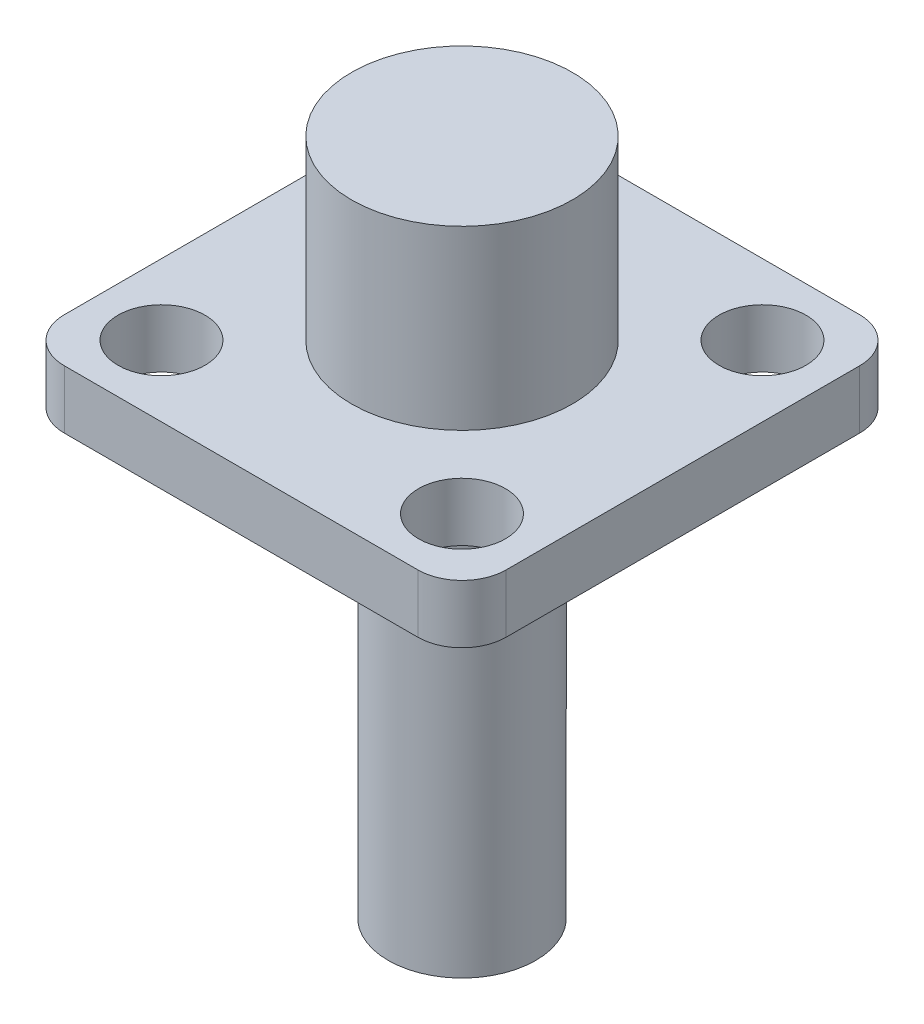
ISO-10303-21;
HEADER;
FILE_DESCRIPTION(('STEP AP214'),'2;1');
FILE_NAME('part.step','',(''),(''),'','','');
FILE_SCHEMA(('AUTOMOTIVE_DESIGN { 1 0 10303 214 1 1 1 1 }'));
ENDSEC;
DATA;
#1=APPLICATION_CONTEXT('core data for automotive mechanical design processes');
#2=APPLICATION_PROTOCOL_DEFINITION('international standard','automotive_design',2000,#1);
#3=PRODUCT_CONTEXT('',#1,'mechanical');
#4=PRODUCT('Part','Part','',(#3));
#5=PRODUCT_RELATED_PRODUCT_CATEGORY('part','',(#4));
#6=PRODUCT_DEFINITION_FORMATION('','',#4);
#7=PRODUCT_DEFINITION_CONTEXT('part definition',#1,'design');
#8=PRODUCT_DEFINITION('design','',#6,#7);
#9=PRODUCT_DEFINITION_SHAPE('','',#8);
#10=(LENGTH_UNIT() NAMED_UNIT(*) SI_UNIT(.MILLI.,.METRE.));
#11=(NAMED_UNIT(*) PLANE_ANGLE_UNIT() SI_UNIT($,.RADIAN.));
#12=(NAMED_UNIT(*) SI_UNIT($,.STERADIAN.) SOLID_ANGLE_UNIT());
#13=UNCERTAINTY_MEASURE_WITH_UNIT(LENGTH_MEASURE(1.E-05),#10,'distance_accuracy_value','');
#14=(GEOMETRIC_REPRESENTATION_CONTEXT(3) GLOBAL_UNCERTAINTY_ASSIGNED_CONTEXT((#13)) GLOBAL_UNIT_ASSIGNED_CONTEXT((#10,
#11,#12)) REPRESENTATION_CONTEXT('',''));
#15=CARTESIAN_POINT('',(0.,0.,0.));
#16=DIRECTION('',(0.,0.,1.));
#17=DIRECTION('',(1.,0.,0.));
#18=AXIS2_PLACEMENT_3D('',#15,#16,#17);
#19=CARTESIAN_POINT('',(5.08,1.6764,5.08));
#20=DIRECTION('',(0.,-1.,0.));
#21=DIRECTION('',(0.,0.,-1.));
#22=AXIS2_PLACEMENT_3D('',#19,#20,#21);
#23=CYLINDRICAL_SURFACE('',#22,1.27);
#24=CARTESIAN_POINT('',(5.08,0.,5.08));
#25=DIRECTION('',(0.,1.,0.));
#26=DIRECTION('',(0.,0.,1.));
#27=AXIS2_PLACEMENT_3D('',#24,#25,#26);
#28=CIRCLE('',#27,1.27);
#29=CARTESIAN_POINT('',(5.07999999999999,0.,6.35));
#30=VERTEX_POINT('',#29);
#31=CARTESIAN_POINT('',(6.35,0.,5.07999999999999));
#32=VERTEX_POINT('',#31);
#33=EDGE_CURVE('E150',#30,#32,#28,.T.);
#34=ORIENTED_EDGE('',*,*,#33,.T.);
#35=DIRECTION('',(0.,-1.,0.));
#36=VECTOR('',#35,1.);
#37=CARTESIAN_POINT('',(6.35,1.6764,5.07999999999999));
#38=LINE('',#37,#36);
#39=CARTESIAN_POINT('',(6.35,1.6764,5.07999999999999));
#40=VERTEX_POINT('',#39);
#41=EDGE_CURVE('E57',#40,#32,#38,.T.);
#42=ORIENTED_EDGE('',*,*,#41,.F.);
#43=CARTESIAN_POINT('',(5.08,1.6764,5.08));
#44=DIRECTION('',(0.,1.,0.));
#45=DIRECTION('',(0.,0.,1.));
#46=AXIS2_PLACEMENT_3D('',#43,#44,#45);
#47=CIRCLE('',#46,1.27);
#48=CARTESIAN_POINT('',(5.07999999999999,1.6764,6.35));
#49=VERTEX_POINT('',#48);
#50=EDGE_CURVE('E173',#49,#40,#47,.T.);
#51=ORIENTED_EDGE('',*,*,#50,.F.);
#52=DIRECTION('',(0.,-1.,0.));
#53=VECTOR('',#52,1.);
#54=CARTESIAN_POINT('',(5.07999999999999,1.6764,6.35));
#55=LINE('',#54,#53);
#56=EDGE_CURVE('E146',#49,#30,#55,.T.);
#57=ORIENTED_EDGE('',*,*,#56,.T.);
#58=EDGE_LOOP('',(#34,#42,#51,#57));
#59=FACE_BOUND('',#58,.T.);
#60=ADVANCED_FACE('F48',(#59),#23,.T.);
#61=CARTESIAN_POINT('',(6.35,1.6764,5.07999999999999));
#62=DIRECTION('',(-1.,0.,0.));
#63=DIRECTION('',(0.,0.,1.));
#64=AXIS2_PLACEMENT_3D('',#61,#62,#63);
#65=PLANE('',#64);
#66=DIRECTION('',(0.,0.,-1.));
#67=VECTOR('',#66,1.);
#68=CARTESIAN_POINT('',(6.35,0.,5.07999999999999));
#69=LINE('',#68,#67);
#70=CARTESIAN_POINT('',(6.35,0.,-5.07999999999999));
#71=VERTEX_POINT('',#70);
#72=EDGE_CURVE('E154',#32,#71,#69,.T.);
#73=ORIENTED_EDGE('',*,*,#72,.T.);
#74=DIRECTION('',(0.,-1.,0.));
#75=VECTOR('',#74,1.);
#76=CARTESIAN_POINT('',(6.35,1.6764,-5.07999999999999));
#77=LINE('',#76,#75);
#78=CARTESIAN_POINT('',(6.35,1.6764,-5.07999999999999));
#79=VERTEX_POINT('',#78);
#80=EDGE_CURVE('E188',#79,#71,#77,.T.);
#81=ORIENTED_EDGE('',*,*,#80,.F.);
#82=DIRECTION('',(0.,0.,-1.));
#83=VECTOR('',#82,1.);
#84=CARTESIAN_POINT('',(6.35,1.6764,5.07999999999999));
#85=LINE('',#84,#83);
#86=EDGE_CURVE('E109',#40,#79,#85,.T.);
#87=ORIENTED_EDGE('',*,*,#86,.F.);
#88=ORIENTED_EDGE('',*,*,#41,.T.);
#89=EDGE_LOOP('',(#73,#81,#87,#88));
#90=FACE_BOUND('',#89,.T.);
#91=ADVANCED_FACE('F193',(#90),#65,.F.);
#92=CARTESIAN_POINT('',(5.08,1.6764,-5.08));
#93=DIRECTION('',(0.,-1.,0.));
#94=DIRECTION('',(0.,0.,-1.));
#95=AXIS2_PLACEMENT_3D('',#92,#93,#94);
#96=CYLINDRICAL_SURFACE('',#95,1.27);
#97=CARTESIAN_POINT('',(5.08,0.,-5.08));
#98=DIRECTION('',(0.,1.,0.));
#99=DIRECTION('',(0.,0.,-1.));
#100=AXIS2_PLACEMENT_3D('',#97,#98,#99);
#101=CIRCLE('',#100,1.27);
#102=CARTESIAN_POINT('',(5.07999999999999,0.,-6.35));
#103=VERTEX_POINT('',#102);
#104=EDGE_CURVE('E158',#71,#103,#101,.T.);
#105=ORIENTED_EDGE('',*,*,#104,.T.);
#106=DIRECTION('',(0.,-1.,0.));
#107=VECTOR('',#106,1.);
#108=CARTESIAN_POINT('',(5.07999999999999,1.6764,-6.35));
#109=LINE('',#108,#107);
#110=CARTESIAN_POINT('',(5.07999999999999,1.6764,-6.35));
#111=VERTEX_POINT('',#110);
#112=EDGE_CURVE('E184',#111,#103,#109,.T.);
#113=ORIENTED_EDGE('',*,*,#112,.F.);
#114=CARTESIAN_POINT('',(5.08,1.6764,-5.08));
#115=DIRECTION('',(0.,1.,0.));
#116=DIRECTION('',(0.,0.,-1.));
#117=AXIS2_PLACEMENT_3D('',#114,#115,#116);
#118=CIRCLE('',#117,1.27);
#119=EDGE_CURVE('E212',#79,#111,#118,.T.);
#120=ORIENTED_EDGE('',*,*,#119,.F.);
#121=ORIENTED_EDGE('',*,*,#80,.T.);
#122=EDGE_LOOP('',(#105,#113,#120,#121));
#123=FACE_BOUND('',#122,.T.);
#124=ADVANCED_FACE('F204',(#123),#96,.T.);
#125=CARTESIAN_POINT('',(-5.07999999999999,1.6764,-6.35));
#126=DIRECTION('',(0.,0.,1.));
#127=DIRECTION('',(1.,0.,0.));
#128=AXIS2_PLACEMENT_3D('',#125,#126,#127);
#129=PLANE('',#128);
#130=DIRECTION('',(-1.,0.,0.));
#131=VECTOR('',#130,1.);
#132=CARTESIAN_POINT('',(-5.07999999999999,0.,-6.35));
#133=LINE('',#132,#131);
#134=CARTESIAN_POINT('',(-5.08,0.,-6.35));
#135=VERTEX_POINT('',#134);
#136=EDGE_CURVE('E161',#103,#135,#133,.T.);
#137=ORIENTED_EDGE('',*,*,#136,.T.);
#138=DIRECTION('',(0.,-1.,0.));
#139=VECTOR('',#138,1.);
#140=CARTESIAN_POINT('',(-5.08,1.6764,-6.35));
#141=LINE('',#140,#139);
#142=CARTESIAN_POINT('',(-5.08,1.6764,-6.35));
#143=VERTEX_POINT('',#142);
#144=EDGE_CURVE('E180',#143,#135,#141,.T.);
#145=ORIENTED_EDGE('',*,*,#144,.F.);
#146=DIRECTION('',(-1.,0.,0.));
#147=VECTOR('',#146,1.);
#148=CARTESIAN_POINT('',(-5.07999999999999,1.6764,-6.35));
#149=LINE('',#148,#147);
#150=EDGE_CURVE('E210',#111,#143,#149,.T.);
#151=ORIENTED_EDGE('',*,*,#150,.F.);
#152=ORIENTED_EDGE('',*,*,#112,.T.);
#153=EDGE_LOOP('',(#137,#145,#151,#152));
#154=FACE_BOUND('',#153,.T.);
#155=ADVANCED_FACE('F208',(#154),#129,.F.);
#156=CARTESIAN_POINT('',(-5.08,1.6764,-5.08));
#157=DIRECTION('',(0.,-1.,0.));
#158=DIRECTION('',(0.,0.,-1.));
#159=AXIS2_PLACEMENT_3D('',#156,#157,#158);
#160=CYLINDRICAL_SURFACE('',#159,1.27);
#161=CARTESIAN_POINT('',(-5.08,0.,-5.08));
#162=DIRECTION('',(0.,1.,0.));
#163=DIRECTION('',(0.,0.,-1.));
#164=AXIS2_PLACEMENT_3D('',#161,#162,#163);
#165=CIRCLE('',#164,1.27);
#166=CARTESIAN_POINT('',(-6.35,0.,-5.07999999999999));
#167=VERTEX_POINT('',#166);
#168=EDGE_CURVE('E164',#135,#167,#165,.T.);
#169=ORIENTED_EDGE('',*,*,#168,.T.);
#170=DIRECTION('',(0.,-1.,0.));
#171=VECTOR('',#170,1.);
#172=CARTESIAN_POINT('',(-6.35,1.6764,-5.07999999999999));
#173=LINE('',#172,#171);
#174=CARTESIAN_POINT('',(-6.35,1.6764,-5.07999999999999));
#175=VERTEX_POINT('',#174);
#176=EDGE_CURVE('E139',#175,#167,#173,.T.);
#177=ORIENTED_EDGE('',*,*,#176,.F.);
#178=CARTESIAN_POINT('',(-5.08,1.6764,-5.08));
#179=DIRECTION('',(0.,1.,0.));
#180=DIRECTION('',(0.,0.,-1.));
#181=AXIS2_PLACEMENT_3D('',#178,#179,#180);
#182=CIRCLE('',#181,1.27);
#183=EDGE_CURVE('E128',#143,#175,#182,.T.);
#184=ORIENTED_EDGE('',*,*,#183,.F.);
#185=ORIENTED_EDGE('',*,*,#144,.T.);
#186=EDGE_LOOP('',(#169,#177,#184,#185));
#187=FACE_BOUND('',#186,.T.);
#188=ADVANCED_FACE('F314',(#187),#160,.T.);
#189=CARTESIAN_POINT('',(-6.35,1.6764,5.07999999999999));
#190=DIRECTION('',(1.,0.,0.));
#191=DIRECTION('',(0.,0.,-1.));
#192=AXIS2_PLACEMENT_3D('',#189,#190,#191);
#193=PLANE('',#192);
#194=DIRECTION('',(0.,0.,1.));
#195=VECTOR('',#194,1.);
#196=CARTESIAN_POINT('',(-6.35,0.,5.07999999999999));
#197=LINE('',#196,#195);
#198=CARTESIAN_POINT('',(-6.35,0.,5.07999999999999));
#199=VERTEX_POINT('',#198);
#200=EDGE_CURVE('E137',#167,#199,#197,.T.);
#201=ORIENTED_EDGE('',*,*,#200,.T.);
#202=DIRECTION('',(0.,-1.,0.));
#203=VECTOR('',#202,1.);
#204=CARTESIAN_POINT('',(-6.35,1.6764,5.07999999999999));
#205=LINE('',#204,#203);
#206=CARTESIAN_POINT('',(-6.35,1.6764,5.07999999999999));
#207=VERTEX_POINT('',#206);
#208=EDGE_CURVE('E134',#207,#199,#205,.T.);
#209=ORIENTED_EDGE('',*,*,#208,.F.);
#210=DIRECTION('',(0.,0.,1.));
#211=VECTOR('',#210,1.);
#212=CARTESIAN_POINT('',(-6.35,1.6764,5.07999999999999));
#213=LINE('',#212,#211);
#214=EDGE_CURVE('E122',#175,#207,#213,.T.);
#215=ORIENTED_EDGE('',*,*,#214,.F.);
#216=ORIENTED_EDGE('',*,*,#176,.T.);
#217=EDGE_LOOP('',(#201,#209,#215,#216));
#218=FACE_BOUND('',#217,.T.);
#219=ADVANCED_FACE('F135',(#218),#193,.F.);
#220=CARTESIAN_POINT('',(-5.08,1.6764,5.08));
#221=DIRECTION('',(0.,-1.,0.));
#222=DIRECTION('',(0.,0.,-1.));
#223=AXIS2_PLACEMENT_3D('',#220,#221,#222);
#224=CYLINDRICAL_SURFACE('',#223,1.27);
#225=CARTESIAN_POINT('',(-5.08,0.,5.08));
#226=DIRECTION('',(0.,1.,0.));
#227=DIRECTION('',(0.,0.,-1.));
#228=AXIS2_PLACEMENT_3D('',#225,#226,#227);
#229=CIRCLE('',#228,1.27);
#230=CARTESIAN_POINT('',(-5.07999999999999,0.,6.35));
#231=VERTEX_POINT('',#230);
#232=EDGE_CURVE('E94',#199,#231,#229,.T.);
#233=ORIENTED_EDGE('',*,*,#232,.T.);
#234=DIRECTION('',(0.,-1.,0.));
#235=VECTOR('',#234,1.);
#236=CARTESIAN_POINT('',(-5.07999999999999,1.6764,6.35));
#237=LINE('',#236,#235);
#238=CARTESIAN_POINT('',(-5.07999999999999,1.6764,6.35));
#239=VERTEX_POINT('',#238);
#240=EDGE_CURVE('E140',#239,#231,#237,.T.);
#241=ORIENTED_EDGE('',*,*,#240,.F.);
#242=CARTESIAN_POINT('',(-5.08,1.6764,5.08));
#243=DIRECTION('',(0.,1.,0.));
#244=DIRECTION('',(0.,0.,-1.));
#245=AXIS2_PLACEMENT_3D('',#242,#243,#244);
#246=CIRCLE('',#245,1.27);
#247=EDGE_CURVE('E126',#207,#239,#246,.T.);
#248=ORIENTED_EDGE('',*,*,#247,.F.);
#249=ORIENTED_EDGE('',*,*,#208,.T.);
#250=EDGE_LOOP('',(#233,#241,#248,#249));
#251=FACE_BOUND('',#250,.T.);
#252=ADVANCED_FACE('F142',(#251),#224,.T.);
#253=CARTESIAN_POINT('',(-5.07999999999999,1.6764,6.35));
#254=DIRECTION('',(0.,0.,-1.));
#255=DIRECTION('',(-1.,0.,0.));
#256=AXIS2_PLACEMENT_3D('',#253,#254,#255);
#257=PLANE('',#256);
#258=DIRECTION('',(1.,0.,0.));
#259=VECTOR('',#258,1.);
#260=CARTESIAN_POINT('',(-5.07999999999999,0.,6.35));
#261=LINE('',#260,#259);
#262=EDGE_CURVE('E100',#231,#30,#261,.T.);
#263=ORIENTED_EDGE('',*,*,#262,.T.);
#264=ORIENTED_EDGE('',*,*,#56,.F.);
#265=DIRECTION('',(1.,0.,0.));
#266=VECTOR('',#265,1.);
#267=CARTESIAN_POINT('',(-5.07999999999999,1.6764,6.35));
#268=LINE('',#267,#266);
#269=EDGE_CURVE('E65',#239,#49,#268,.T.);
#270=ORIENTED_EDGE('',*,*,#269,.F.);
#271=ORIENTED_EDGE('',*,*,#240,.T.);
#272=EDGE_LOOP('',(#263,#264,#270,#271));
#273=FACE_BOUND('',#272,.T.);
#274=ADVANCED_FACE('F294',(#273),#257,.F.);
#275=CARTESIAN_POINT('',(5.08,1.6764,5.08));
#276=DIRECTION('',(0.,1.,0.));
#277=DIRECTION('',(0.,0.,1.));
#278=AXIS2_PLACEMENT_3D('',#275,#276,#277);
#279=PLANE('',#278);
#280=CARTESIAN_POINT('',(0.,1.6764,0.));
#281=DIRECTION('',(0.,1.,0.));
#282=DIRECTION('',(0.,0.,1.));
#283=AXIS2_PLACEMENT_3D('',#280,#281,#282);
#284=CIRCLE('',#283,3.175);
#285=CARTESIAN_POINT('',(0.,1.6764,3.175));
#286=VERTEX_POINT('',#285);
#287=EDGE_CURVE('E254',#286,#286,#284,.T.);
#288=ORIENTED_EDGE('',*,*,#287,.F.);
#289=EDGE_LOOP('',(#288));
#290=FACE_BOUND('',#289,.T.);
#291=CARTESIAN_POINT('',(4.318,1.6764,-4.318));
#292=DIRECTION('',(0.,1.,0.));
#293=DIRECTION('',(0.,0.,1.));
#294=AXIS2_PLACEMENT_3D('',#291,#292,#293);
#295=CIRCLE('',#294,1.24999999999999);
#296=CARTESIAN_POINT('',(4.318,1.6764,-3.06800000000001));
#297=VERTEX_POINT('',#296);
#298=EDGE_CURVE('E249',#297,#297,#295,.T.);
#299=ORIENTED_EDGE('',*,*,#298,.F.);
#300=EDGE_LOOP('',(#299));
#301=FACE_BOUND('',#300,.T.);
#302=CARTESIAN_POINT('',(-4.318,1.6764,4.318));
#303=DIRECTION('',(0.,1.,0.));
#304=DIRECTION('',(0.,0.,1.));
#305=AXIS2_PLACEMENT_3D('',#302,#303,#304);
#306=CIRCLE('',#305,1.24999999999999);
#307=CARTESIAN_POINT('',(-4.318,1.6764,5.56799999999999));
#308=VERTEX_POINT('',#307);
#309=EDGE_CURVE('E241',#308,#308,#306,.T.);
#310=ORIENTED_EDGE('',*,*,#309,.F.);
#311=EDGE_LOOP('',(#310));
#312=FACE_BOUND('',#311,.T.);
#313=CARTESIAN_POINT('',(-4.318,1.6764,-4.318));
#314=DIRECTION('',(0.,1.,0.));
#315=DIRECTION('',(0.,0.,1.));
#316=AXIS2_PLACEMENT_3D('',#313,#314,#315);
#317=CIRCLE('',#316,1.24999999999999);
#318=CARTESIAN_POINT('',(-4.318,1.6764,-3.06800000000001));
#319=VERTEX_POINT('',#318);
#320=EDGE_CURVE('E233',#319,#319,#317,.T.);
#321=ORIENTED_EDGE('',*,*,#320,.F.);
#322=EDGE_LOOP('',(#321));
#323=FACE_BOUND('',#322,.T.);
#324=CARTESIAN_POINT('',(4.318,1.6764,4.318));
#325=DIRECTION('',(0.,1.,0.));
#326=DIRECTION('',(0.,0.,1.));
#327=AXIS2_PLACEMENT_3D('',#324,#325,#326);
#328=CIRCLE('',#327,1.24999999999999);
#329=CARTESIAN_POINT('',(4.318,1.6764,5.56799999999999));
#330=VERTEX_POINT('',#329);
#331=EDGE_CURVE('E225',#330,#330,#328,.T.);
#332=ORIENTED_EDGE('',*,*,#331,.F.);
#333=EDGE_LOOP('',(#332));
#334=FACE_BOUND('',#333,.T.);
#335=ORIENTED_EDGE('',*,*,#50,.T.);
#336=ORIENTED_EDGE('',*,*,#86,.T.);
#337=ORIENTED_EDGE('',*,*,#119,.T.);
#338=ORIENTED_EDGE('',*,*,#150,.T.);
#339=ORIENTED_EDGE('',*,*,#183,.T.);
#340=ORIENTED_EDGE('',*,*,#214,.T.);
#341=ORIENTED_EDGE('',*,*,#247,.T.);
#342=ORIENTED_EDGE('',*,*,#269,.T.);
#343=EDGE_LOOP('',(#335,#336,#337,#338,#339,#340,#341,#342));
#344=FACE_BOUND('',#343,.T.);
#345=ADVANCED_FACE('F124',(#290,#301,#312,#323,#334,#344),#279,.T.);
#346=CARTESIAN_POINT('',(5.08,0.,5.08));
#347=DIRECTION('',(0.,1.,0.));
#348=DIRECTION('',(0.,0.,1.));
#349=AXIS2_PLACEMENT_3D('',#346,#347,#348);
#350=PLANE('',#349);
#351=CARTESIAN_POINT('',(0.,0.,0.));
#352=DIRECTION('',(0.,1.,0.));
#353=DIRECTION('',(0.,0.,1.));
#354=AXIS2_PLACEMENT_3D('',#351,#352,#353);
#355=CIRCLE('',#354,2.1209);
#356=CARTESIAN_POINT('',(0.,0.,2.1209));
#357=VERTEX_POINT('',#356);
#358=EDGE_CURVE('E11',#357,#357,#355,.F.);
#359=ORIENTED_EDGE('',*,*,#358,.F.);
#360=EDGE_LOOP('',(#359));
#361=FACE_BOUND('',#360,.T.);
#362=CARTESIAN_POINT('',(4.318,0.,-4.318));
#363=DIRECTION('',(0.,1.,0.));
#364=DIRECTION('',(0.,0.,1.));
#365=AXIS2_PLACEMENT_3D('',#362,#363,#364);
#366=CIRCLE('',#365,1.25);
#367=CARTESIAN_POINT('',(4.318,0.,-3.068));
#368=VERTEX_POINT('',#367);
#369=EDGE_CURVE('E245',#368,#368,#366,.T.);
#370=ORIENTED_EDGE('',*,*,#369,.T.);
#371=EDGE_LOOP('',(#370));
#372=FACE_BOUND('',#371,.T.);
#373=CARTESIAN_POINT('',(-4.318,0.,4.318));
#374=DIRECTION('',(0.,1.,0.));
#375=DIRECTION('',(0.,0.,1.));
#376=AXIS2_PLACEMENT_3D('',#373,#374,#375);
#377=CIRCLE('',#376,1.25);
#378=CARTESIAN_POINT('',(-4.318,0.,5.568));
#379=VERTEX_POINT('',#378);
#380=EDGE_CURVE('E237',#379,#379,#377,.T.);
#381=ORIENTED_EDGE('',*,*,#380,.T.);
#382=EDGE_LOOP('',(#381));
#383=FACE_BOUND('',#382,.T.);
#384=CARTESIAN_POINT('',(-4.318,0.,-4.318));
#385=DIRECTION('',(0.,1.,0.));
#386=DIRECTION('',(0.,0.,1.));
#387=AXIS2_PLACEMENT_3D('',#384,#385,#386);
#388=CIRCLE('',#387,1.25);
#389=CARTESIAN_POINT('',(-4.318,0.,-3.068));
#390=VERTEX_POINT('',#389);
#391=EDGE_CURVE('E229',#390,#390,#388,.T.);
#392=ORIENTED_EDGE('',*,*,#391,.T.);
#393=EDGE_LOOP('',(#392));
#394=FACE_BOUND('',#393,.T.);
#395=CARTESIAN_POINT('',(4.318,0.,4.318));
#396=DIRECTION('',(0.,1.,0.));
#397=DIRECTION('',(0.,0.,1.));
#398=AXIS2_PLACEMENT_3D('',#395,#396,#397);
#399=CIRCLE('',#398,1.25);
#400=CARTESIAN_POINT('',(4.318,0.,5.568));
#401=VERTEX_POINT('',#400);
#402=EDGE_CURVE('E155',#401,#401,#399,.T.);
#403=ORIENTED_EDGE('',*,*,#402,.T.);
#404=EDGE_LOOP('',(#403));
#405=FACE_BOUND('',#404,.T.);
#406=ORIENTED_EDGE('',*,*,#33,.F.);
#407=ORIENTED_EDGE('',*,*,#262,.F.);
#408=ORIENTED_EDGE('',*,*,#232,.F.);
#409=ORIENTED_EDGE('',*,*,#200,.F.);
#410=ORIENTED_EDGE('',*,*,#168,.F.);
#411=ORIENTED_EDGE('',*,*,#136,.F.);
#412=ORIENTED_EDGE('',*,*,#104,.F.);
#413=ORIENTED_EDGE('',*,*,#72,.F.);
#414=EDGE_LOOP('',(#406,#407,#408,#409,#410,#411,#412,#413));
#415=FACE_BOUND('',#414,.T.);
#416=ADVANCED_FACE('F198',(#361,#372,#383,#394,#405,#415),#350,.F.);
#417=CARTESIAN_POINT('',(4.318,1.6764,4.318));
#418=DIRECTION('',(0.,1.,0.));
#419=DIRECTION('',(0.,0.,1.));
#420=AXIS2_PLACEMENT_3D('',#417,#418,#419);
#421=CYLINDRICAL_SURFACE('',#420,1.24999999999999);
#422=ORIENTED_EDGE('',*,*,#402,.F.);
#423=EDGE_LOOP('',(#422));
#424=FACE_BOUND('',#423,.T.);
#425=ORIENTED_EDGE('',*,*,#331,.T.);
#426=EDGE_LOOP('',(#425));
#427=FACE_BOUND('',#426,.T.);
#428=ADVANCED_FACE('F277',(#424,#427),#421,.F.);
#429=CARTESIAN_POINT('',(-4.318,1.6764,-4.318));
#430=DIRECTION('',(0.,1.,0.));
#431=DIRECTION('',(0.,0.,1.));
#432=AXIS2_PLACEMENT_3D('',#429,#430,#431);
#433=CYLINDRICAL_SURFACE('',#432,1.24999999999999);
#434=ORIENTED_EDGE('',*,*,#391,.F.);
#435=EDGE_LOOP('',(#434));
#436=FACE_BOUND('',#435,.T.);
#437=ORIENTED_EDGE('',*,*,#320,.T.);
#438=EDGE_LOOP('',(#437));
#439=FACE_BOUND('',#438,.T.);
#440=ADVANCED_FACE('F289',(#436,#439),#433,.F.);
#441=CARTESIAN_POINT('',(-4.318,1.6764,4.318));
#442=DIRECTION('',(0.,1.,0.));
#443=DIRECTION('',(0.,0.,1.));
#444=AXIS2_PLACEMENT_3D('',#441,#442,#443);
#445=CYLINDRICAL_SURFACE('',#444,1.24999999999999);
#446=ORIENTED_EDGE('',*,*,#380,.F.);
#447=EDGE_LOOP('',(#446));
#448=FACE_BOUND('',#447,.T.);
#449=ORIENTED_EDGE('',*,*,#309,.T.);
#450=EDGE_LOOP('',(#449));
#451=FACE_BOUND('',#450,.T.);
#452=ADVANCED_FACE('F358',(#448,#451),#445,.F.);
#453=CARTESIAN_POINT('',(4.318,1.6764,-4.318));
#454=DIRECTION('',(0.,1.,0.));
#455=DIRECTION('',(0.,0.,1.));
#456=AXIS2_PLACEMENT_3D('',#453,#454,#455);
#457=CYLINDRICAL_SURFACE('',#456,1.24999999999999);
#458=ORIENTED_EDGE('',*,*,#369,.F.);
#459=EDGE_LOOP('',(#458));
#460=FACE_BOUND('',#459,.T.);
#461=ORIENTED_EDGE('',*,*,#298,.T.);
#462=EDGE_LOOP('',(#461));
#463=FACE_BOUND('',#462,.T.);
#464=ADVANCED_FACE('F368',(#460,#463),#457,.F.);
#465=CARTESIAN_POINT('',(0.,6.7564,0.));
#466=DIRECTION('',(0.,-1.,0.));
#467=DIRECTION('',(0.,0.,-1.));
#468=AXIS2_PLACEMENT_3D('',#465,#466,#467);
#469=CYLINDRICAL_SURFACE('',#468,3.175);
#470=CARTESIAN_POINT('',(0.,6.7564,0.));
#471=DIRECTION('',(0.,1.,0.));
#472=DIRECTION('',(0.,0.,1.));
#473=AXIS2_PLACEMENT_3D('',#470,#471,#472);
#474=CIRCLE('',#473,3.175);
#475=CARTESIAN_POINT('',(0.,6.7564,3.175));
#476=VERTEX_POINT('',#475);
#477=EDGE_CURVE('E253',#476,#476,#474,.T.);
#478=ORIENTED_EDGE('',*,*,#477,.F.);
#479=EDGE_LOOP('',(#478));
#480=FACE_BOUND('',#479,.T.);
#481=ORIENTED_EDGE('',*,*,#287,.T.);
#482=EDGE_LOOP('',(#481));
#483=FACE_BOUND('',#482,.T.);
#484=ADVANCED_FACE('F377',(#480,#483),#469,.T.);
#485=CARTESIAN_POINT('',(0.,6.7564,0.));
#486=DIRECTION('',(0.,1.,0.));
#487=DIRECTION('',(0.,0.,1.));
#488=AXIS2_PLACEMENT_3D('',#485,#486,#487);
#489=PLANE('',#488);
#490=ORIENTED_EDGE('',*,*,#477,.T.);
#491=EDGE_LOOP('',(#490));
#492=FACE_BOUND('',#491,.T.);
#493=ADVANCED_FACE('F271',(#492),#489,.T.);
#494=CARTESIAN_POINT('',(0.,-12.7,0.));
#495=DIRECTION('',(0.,1.,0.));
#496=DIRECTION('',(0.,0.,1.));
#497=AXIS2_PLACEMENT_3D('',#494,#495,#496);
#498=CYLINDRICAL_SURFACE('',#497,2.1209);
#499=CARTESIAN_POINT('',(0.,-12.7,0.));
#500=DIRECTION('',(0.,-1.,0.));
#501=DIRECTION('',(0.,0.,-1.));
#502=AXIS2_PLACEMENT_3D('',#499,#500,#501);
#503=CIRCLE('',#502,2.1209);
#504=CARTESIAN_POINT('',(0.,-12.7,-2.1209));
#505=VERTEX_POINT('',#504);
#506=EDGE_CURVE('E258',#505,#505,#503,.T.);
#507=ORIENTED_EDGE('',*,*,#506,.F.);
#508=EDGE_LOOP('',(#507));
#509=FACE_BOUND('',#508,.T.);
#510=ORIENTED_EDGE('',*,*,#358,.T.);
#511=EDGE_LOOP('',(#510));
#512=FACE_BOUND('',#511,.T.);
#513=ADVANCED_FACE('F268',(#509,#512),#498,.T.);
#514=CARTESIAN_POINT('',(0.,-12.7,0.));
#515=DIRECTION('',(0.,-1.,0.));
#516=DIRECTION('',(0.,0.,-1.));
#517=AXIS2_PLACEMENT_3D('',#514,#515,#516);
#518=PLANE('',#517);
#519=ORIENTED_EDGE('',*,*,#506,.T.);
#520=EDGE_LOOP('',(#519));
#521=FACE_BOUND('',#520,.T.);
#522=ADVANCED_FACE('F266',(#521),#518,.T.);
#523=CLOSED_SHELL('',(#60,#91,#124,#155,#188,#219,#252,#274,#345,#416,#428,#440,#452,#464,#484,
#493,#513,#522));
#524=MANIFOLD_SOLID_BREP('B2',#523);
#525=ADVANCED_BREP_SHAPE_REPRESENTATION('',(#18,#524),#14);
#526=SHAPE_DEFINITION_REPRESENTATION(#9,#525);
ENDSEC;
END-ISO-10303-21;
